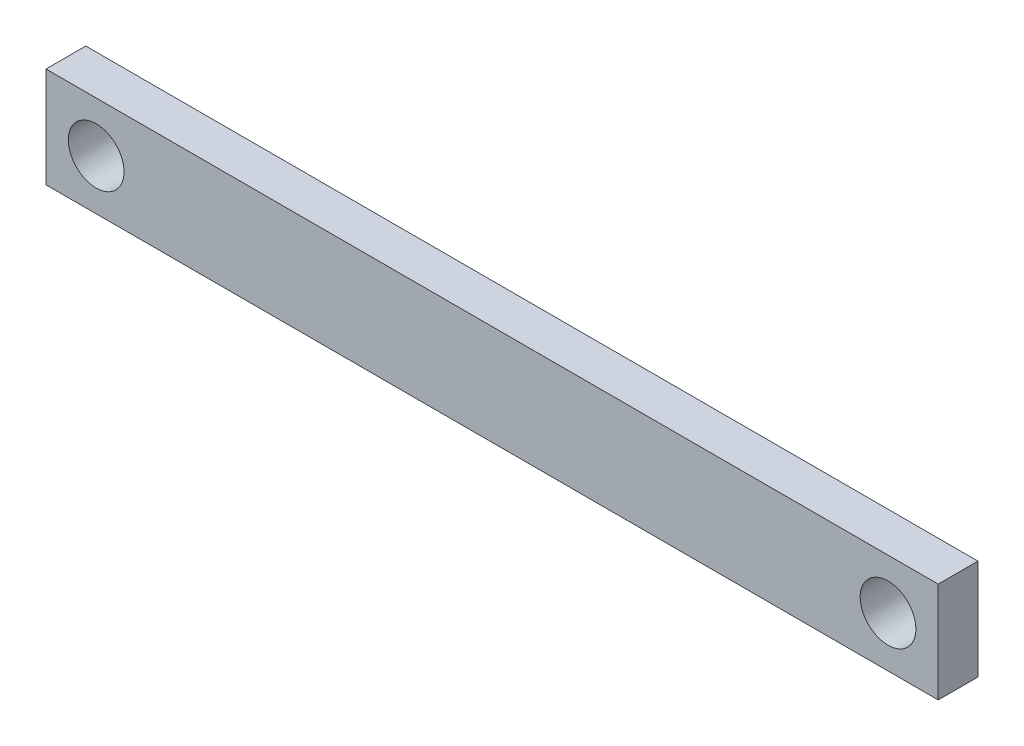
ISO-10303-21;
HEADER;
FILE_DESCRIPTION(('STEP AP214'),'2;1');
FILE_NAME('part.step','',(''),(''),'','','');
FILE_SCHEMA(('AUTOMOTIVE_DESIGN { 1 0 10303 214 1 1 1 1 }'));
ENDSEC;
DATA;
#1=APPLICATION_CONTEXT('core data for automotive mechanical design processes');
#2=APPLICATION_PROTOCOL_DEFINITION('international standard','automotive_design',2000,#1);
#3=PRODUCT_CONTEXT('',#1,'mechanical');
#4=PRODUCT('Part','Part','',(#3));
#5=PRODUCT_RELATED_PRODUCT_CATEGORY('part','',(#4));
#6=PRODUCT_DEFINITION_FORMATION('','',#4);
#7=PRODUCT_DEFINITION_CONTEXT('part definition',#1,'design');
#8=PRODUCT_DEFINITION('design','',#6,#7);
#9=PRODUCT_DEFINITION_SHAPE('','',#8);
#10=(LENGTH_UNIT() NAMED_UNIT(*) SI_UNIT(.MILLI.,.METRE.));
#11=(NAMED_UNIT(*) PLANE_ANGLE_UNIT() SI_UNIT($,.RADIAN.));
#12=(NAMED_UNIT(*) SI_UNIT($,.STERADIAN.) SOLID_ANGLE_UNIT());
#13=UNCERTAINTY_MEASURE_WITH_UNIT(LENGTH_MEASURE(1.E-05),#10,'distance_accuracy_value','');
#14=(GEOMETRIC_REPRESENTATION_CONTEXT(3) GLOBAL_UNCERTAINTY_ASSIGNED_CONTEXT((#13)) GLOBAL_UNIT_ASSIGNED_CONTEXT((#10,
#11,#12)) REPRESENTATION_CONTEXT('',''));
#15=CARTESIAN_POINT('',(0.,0.,0.));
#16=DIRECTION('',(0.,0.,1.));
#17=DIRECTION('',(1.,0.,0.));
#18=AXIS2_PLACEMENT_3D('',#15,#16,#17);
#19=CARTESIAN_POINT('',(0.,-3.20300000000002,2.54));
#20=DIRECTION('',(0.,1.,0.));
#21=DIRECTION('',(-1.,0.,0.));
#22=AXIS2_PLACEMENT_3D('',#19,#20,#21);
#23=PLANE('',#22);
#24=DIRECTION('',(1.,0.,0.));
#25=VECTOR('',#24,1.);
#26=CARTESIAN_POINT('',(0.,-3.20300000000002,0.));
#27=LINE('',#26,#25);
#28=CARTESIAN_POINT('',(-28.481,-3.20300000000002,0.));
#29=VERTEX_POINT('',#28);
#30=CARTESIAN_POINT('',(28.481,-3.20300000000002,0.));
#31=VERTEX_POINT('',#30);
#32=EDGE_CURVE('E107',#29,#31,#27,.T.);
#33=ORIENTED_EDGE('',*,*,#32,.T.);
#34=DIRECTION('',(0.,0.,-1.));
#35=VECTOR('',#34,1.);
#36=CARTESIAN_POINT('',(28.481,-3.20300000000002,2.54));
#37=LINE('',#36,#35);
#38=CARTESIAN_POINT('',(28.481,-3.20300000000002,2.54));
#39=VERTEX_POINT('',#38);
#40=EDGE_CURVE('E11',#39,#31,#37,.T.);
#41=ORIENTED_EDGE('',*,*,#40,.F.);
#42=DIRECTION('',(1.,0.,0.));
#43=VECTOR('',#42,1.);
#44=CARTESIAN_POINT('',(0.,-3.20300000000002,2.54));
#45=LINE('',#44,#43);
#46=CARTESIAN_POINT('',(-28.481,-3.20300000000002,2.54));
#47=VERTEX_POINT('',#46);
#48=EDGE_CURVE('E87',#47,#39,#45,.T.);
#49=ORIENTED_EDGE('',*,*,#48,.F.);
#50=DIRECTION('',(0.,0.,-1.));
#51=VECTOR('',#50,1.);
#52=CARTESIAN_POINT('',(-28.481,-3.20300000000002,2.54));
#53=LINE('',#52,#51);
#54=EDGE_CURVE('E53',#47,#29,#53,.T.);
#55=ORIENTED_EDGE('',*,*,#54,.T.);
#56=EDGE_LOOP('',(#33,#41,#49,#55));
#57=FACE_BOUND('',#56,.T.);
#58=ADVANCED_FACE('F37',(#57),#23,.F.);
#59=CARTESIAN_POINT('',(28.481,0.,2.54));
#60=DIRECTION('',(-1.,0.,0.));
#61=DIRECTION('',(0.,0.,1.));
#62=AXIS2_PLACEMENT_3D('',#59,#60,#61);
#63=PLANE('',#62);
#64=DIRECTION('',(0.,1.,0.));
#65=VECTOR('',#64,1.);
#66=CARTESIAN_POINT('',(28.481,0.,0.));
#67=LINE('',#66,#65);
#68=CARTESIAN_POINT('',(28.481,3.203,0.));
#69=VERTEX_POINT('',#68);
#70=EDGE_CURVE('E92',#31,#69,#67,.T.);
#71=ORIENTED_EDGE('',*,*,#70,.T.);
#72=DIRECTION('',(0.,0.,-1.));
#73=VECTOR('',#72,1.);
#74=CARTESIAN_POINT('',(28.481,3.203,2.54));
#75=LINE('',#74,#73);
#76=CARTESIAN_POINT('',(28.481,3.203,2.54));
#77=VERTEX_POINT('',#76);
#78=EDGE_CURVE('E45',#77,#69,#75,.T.);
#79=ORIENTED_EDGE('',*,*,#78,.F.);
#80=DIRECTION('',(0.,1.,0.));
#81=VECTOR('',#80,1.);
#82=CARTESIAN_POINT('',(28.481,0.,2.54));
#83=LINE('',#82,#81);
#84=EDGE_CURVE('E78',#39,#77,#83,.T.);
#85=ORIENTED_EDGE('',*,*,#84,.F.);
#86=ORIENTED_EDGE('',*,*,#40,.T.);
#87=EDGE_LOOP('',(#71,#79,#85,#86));
#88=FACE_BOUND('',#87,.T.);
#89=ADVANCED_FACE('F91',(#88),#63,.F.);
#90=CARTESIAN_POINT('',(0.,3.20299999999999,2.54));
#91=DIRECTION('',(0.,1.,0.));
#92=DIRECTION('',(-1.,0.,0.));
#93=AXIS2_PLACEMENT_3D('',#90,#91,#92);
#94=PLANE('',#93);
#95=DIRECTION('',(1.,0.,0.));
#96=VECTOR('',#95,1.);
#97=CARTESIAN_POINT('',(0.,3.20299999999999,0.));
#98=LINE('',#97,#96);
#99=CARTESIAN_POINT('',(-28.481,3.20299999999999,0.));
#100=VERTEX_POINT('',#99);
#101=EDGE_CURVE('E110',#100,#69,#98,.T.);
#102=ORIENTED_EDGE('',*,*,#101,.F.);
#103=DIRECTION('',(0.,0.,-1.));
#104=VECTOR('',#103,1.);
#105=CARTESIAN_POINT('',(-28.481,3.20299999999999,2.54));
#106=LINE('',#105,#104);
#107=CARTESIAN_POINT('',(-28.481,3.20299999999999,2.54));
#108=VERTEX_POINT('',#107);
#109=EDGE_CURVE('E67',#108,#100,#106,.T.);
#110=ORIENTED_EDGE('',*,*,#109,.F.);
#111=DIRECTION('',(1.,0.,0.));
#112=VECTOR('',#111,1.);
#113=CARTESIAN_POINT('',(0.,3.20299999999999,2.54));
#114=LINE('',#113,#112);
#115=EDGE_CURVE('E86',#108,#77,#114,.T.);
#116=ORIENTED_EDGE('',*,*,#115,.T.);
#117=ORIENTED_EDGE('',*,*,#78,.T.);
#118=EDGE_LOOP('',(#102,#110,#116,#117));
#119=FACE_BOUND('',#118,.T.);
#120=ADVANCED_FACE('F95',(#119),#94,.T.);
#121=CARTESIAN_POINT('',(25.278,0.,2.54));
#122=DIRECTION('',(0.,0.,-1.));
#123=DIRECTION('',(-1.,0.,0.));
#124=AXIS2_PLACEMENT_3D('',#121,#122,#123);
#125=CYLINDRICAL_SURFACE('',#124,1.778);
#126=CARTESIAN_POINT('',(25.278,0.,2.54));
#127=DIRECTION('',(0.,0.,1.));
#128=DIRECTION('',(1.,0.,0.));
#129=AXIS2_PLACEMENT_3D('',#126,#127,#128);
#130=CIRCLE('',#129,1.778);
#131=CARTESIAN_POINT('',(27.056,0.,2.54));
#132=VERTEX_POINT('',#131);
#133=EDGE_CURVE('E98',#132,#132,#130,.F.);
#134=ORIENTED_EDGE('',*,*,#133,.F.);
#135=EDGE_LOOP('',(#134));
#136=FACE_BOUND('',#135,.T.);
#137=CARTESIAN_POINT('',(25.278,0.,0.));
#138=DIRECTION('',(0.,0.,1.));
#139=DIRECTION('',(1.,0.,0.));
#140=AXIS2_PLACEMENT_3D('',#137,#138,#139);
#141=CIRCLE('',#140,1.778);
#142=CARTESIAN_POINT('',(27.056,0.,0.));
#143=VERTEX_POINT('',#142);
#144=EDGE_CURVE('E115',#143,#143,#141,.F.);
#145=ORIENTED_EDGE('',*,*,#144,.T.);
#146=EDGE_LOOP('',(#145));
#147=FACE_BOUND('',#146,.T.);
#148=ADVANCED_FACE('F136',(#136,#147),#125,.F.);
#149=CARTESIAN_POINT('',(-28.481,0.,2.54));
#150=DIRECTION('',(-1.,0.,0.));
#151=DIRECTION('',(0.,0.,1.));
#152=AXIS2_PLACEMENT_3D('',#149,#150,#151);
#153=PLANE('',#152);
#154=DIRECTION('',(0.,1.,0.));
#155=VECTOR('',#154,1.);
#156=CARTESIAN_POINT('',(-28.481,0.,0.));
#157=LINE('',#156,#155);
#158=EDGE_CURVE('E112',#29,#100,#157,.T.);
#159=ORIENTED_EDGE('',*,*,#158,.F.);
#160=ORIENTED_EDGE('',*,*,#54,.F.);
#161=DIRECTION('',(0.,1.,0.));
#162=VECTOR('',#161,1.);
#163=CARTESIAN_POINT('',(-28.481,0.,2.54));
#164=LINE('',#163,#162);
#165=EDGE_CURVE('E96',#47,#108,#164,.T.);
#166=ORIENTED_EDGE('',*,*,#165,.T.);
#167=ORIENTED_EDGE('',*,*,#109,.T.);
#168=EDGE_LOOP('',(#159,#160,#166,#167));
#169=FACE_BOUND('',#168,.T.);
#170=ADVANCED_FACE('F128',(#169),#153,.T.);
#171=CARTESIAN_POINT('',(-25.278,0.,2.54));
#172=DIRECTION('',(0.,0.,-1.));
#173=DIRECTION('',(-1.,0.,0.));
#174=AXIS2_PLACEMENT_3D('',#171,#172,#173);
#175=CYLINDRICAL_SURFACE('',#174,1.778);
#176=CARTESIAN_POINT('',(-25.278,0.,2.54));
#177=DIRECTION('',(0.,0.,1.));
#178=DIRECTION('',(1.,0.,0.));
#179=AXIS2_PLACEMENT_3D('',#176,#177,#178);
#180=CIRCLE('',#179,1.778);
#181=CARTESIAN_POINT('',(-23.5,0.,2.54));
#182=VERTEX_POINT('',#181);
#183=EDGE_CURVE('E104',#182,#182,#180,.T.);
#184=ORIENTED_EDGE('',*,*,#183,.T.);
#185=EDGE_LOOP('',(#184));
#186=FACE_BOUND('',#185,.T.);
#187=CARTESIAN_POINT('',(-25.278,0.,0.));
#188=DIRECTION('',(0.,0.,1.));
#189=DIRECTION('',(1.,0.,0.));
#190=AXIS2_PLACEMENT_3D('',#187,#188,#189);
#191=CIRCLE('',#190,1.778);
#192=CARTESIAN_POINT('',(-23.5,0.,0.));
#193=VERTEX_POINT('',#192);
#194=EDGE_CURVE('E118',#193,#193,#191,.T.);
#195=ORIENTED_EDGE('',*,*,#194,.F.);
#196=EDGE_LOOP('',(#195));
#197=FACE_BOUND('',#196,.T.);
#198=ADVANCED_FACE('F126',(#186,#197),#175,.F.);
#199=CARTESIAN_POINT('',(0.,0.,2.54));
#200=DIRECTION('',(0.,0.,1.));
#201=DIRECTION('',(1.,0.,0.));
#202=AXIS2_PLACEMENT_3D('',#199,#200,#201);
#203=PLANE('',#202);
#204=ORIENTED_EDGE('',*,*,#48,.T.);
#205=ORIENTED_EDGE('',*,*,#84,.T.);
#206=ORIENTED_EDGE('',*,*,#115,.F.);
#207=ORIENTED_EDGE('',*,*,#165,.F.);
#208=EDGE_LOOP('',(#204,#205,#206,#207));
#209=FACE_BOUND('',#208,.T.);
#210=ORIENTED_EDGE('',*,*,#133,.T.);
#211=EDGE_LOOP('',(#210));
#212=FACE_BOUND('',#211,.T.);
#213=ORIENTED_EDGE('',*,*,#183,.F.);
#214=EDGE_LOOP('',(#213));
#215=FACE_BOUND('',#214,.T.);
#216=ADVANCED_FACE('F82',(#209,#212,#215),#203,.T.);
#217=CARTESIAN_POINT('',(0.,0.,0.));
#218=DIRECTION('',(0.,0.,1.));
#219=DIRECTION('',(1.,0.,0.));
#220=AXIS2_PLACEMENT_3D('',#217,#218,#219);
#221=PLANE('',#220);
#222=ORIENTED_EDGE('',*,*,#32,.F.);
#223=ORIENTED_EDGE('',*,*,#158,.T.);
#224=ORIENTED_EDGE('',*,*,#101,.T.);
#225=ORIENTED_EDGE('',*,*,#70,.F.);
#226=EDGE_LOOP('',(#222,#223,#224,#225));
#227=FACE_BOUND('',#226,.T.);
#228=ORIENTED_EDGE('',*,*,#144,.F.);
#229=EDGE_LOOP('',(#228));
#230=FACE_BOUND('',#229,.T.);
#231=ORIENTED_EDGE('',*,*,#194,.T.);
#232=EDGE_LOOP('',(#231));
#233=FACE_BOUND('',#232,.T.);
#234=ADVANCED_FACE('F124',(#227,#230,#233),#221,.F.);
#235=CLOSED_SHELL('',(#58,#89,#120,#148,#170,#198,#216,#234));
#236=MANIFOLD_SOLID_BREP('B2',#235);
#237=ADVANCED_BREP_SHAPE_REPRESENTATION('',(#18,#236),#14);
#238=SHAPE_DEFINITION_REPRESENTATION(#9,#237);
ENDSEC;
END-ISO-10303-21;
